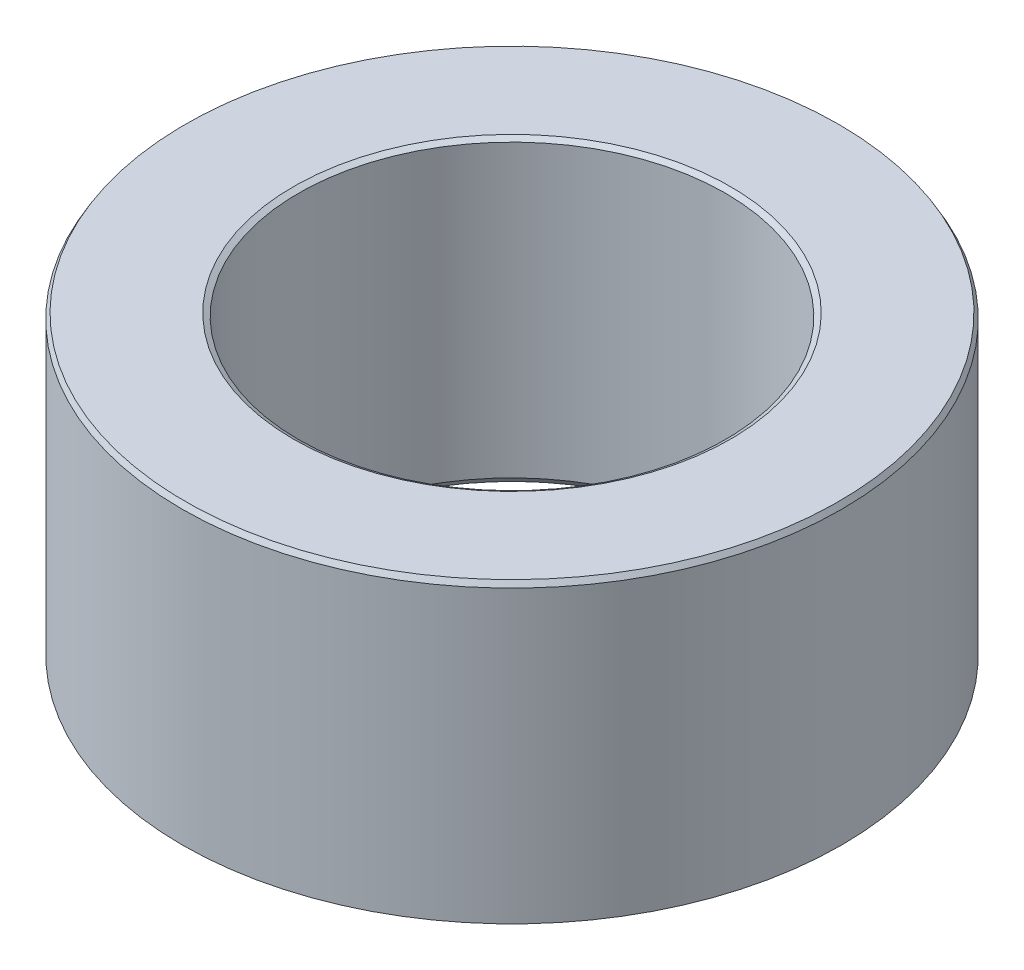
ISO-10303-21;
HEADER;
FILE_DESCRIPTION(('STEP AP214'),'2;1');
FILE_NAME('part.step','',(''),(''),'','','');
FILE_SCHEMA(('AUTOMOTIVE_DESIGN { 1 0 10303 214 1 1 1 1 }'));
ENDSEC;
DATA;
#1=APPLICATION_CONTEXT('core data for automotive mechanical design processes');
#2=APPLICATION_PROTOCOL_DEFINITION('international standard','automotive_design',2000,#1);
#3=PRODUCT_CONTEXT('',#1,'mechanical');
#4=PRODUCT('Part','Part','',(#3));
#5=PRODUCT_RELATED_PRODUCT_CATEGORY('part','',(#4));
#6=PRODUCT_DEFINITION_FORMATION('','',#4);
#7=PRODUCT_DEFINITION_CONTEXT('part definition',#1,'design');
#8=PRODUCT_DEFINITION('design','',#6,#7);
#9=PRODUCT_DEFINITION_SHAPE('','',#8);
#10=(LENGTH_UNIT() NAMED_UNIT(*) SI_UNIT(.MILLI.,.METRE.));
#11=(NAMED_UNIT(*) PLANE_ANGLE_UNIT() SI_UNIT($,.RADIAN.));
#12=(NAMED_UNIT(*) SI_UNIT($,.STERADIAN.) SOLID_ANGLE_UNIT());
#13=UNCERTAINTY_MEASURE_WITH_UNIT(LENGTH_MEASURE(1.E-05),#10,'distance_accuracy_value','');
#14=(GEOMETRIC_REPRESENTATION_CONTEXT(3) GLOBAL_UNCERTAINTY_ASSIGNED_CONTEXT((#13)) GLOBAL_UNIT_ASSIGNED_CONTEXT((#10,
#11,#12)) REPRESENTATION_CONTEXT('',''));
#15=CARTESIAN_POINT('',(0.,0.,0.));
#16=DIRECTION('',(0.,0.,1.));
#17=DIRECTION('',(1.,0.,0.));
#18=AXIS2_PLACEMENT_3D('',#15,#16,#17);
#19=CARTESIAN_POINT('',(0.,40.8145673028736,0.));
#20=DIRECTION('',(0.,-1.,0.));
#21=DIRECTION('',(0.,0.,-1.));
#22=AXIS2_PLACEMENT_3D('',#19,#20,#21);
#23=CYLINDRICAL_SURFACE('',#22,45.);
#24=CARTESIAN_POINT('',(0.,0.411539080149875,0.));
#25=DIRECTION('',(0.,1.,0.));
#26=DIRECTION('',(0.,0.,1.));
#27=AXIS2_PLACEMENT_3D('',#24,#25,#26);
#28=CIRCLE('',#27,45.);
#29=CARTESIAN_POINT('',(0.,0.411539080149875,45.));
#30=VERTEX_POINT('',#29);
#31=EDGE_CURVE('E10',#30,#30,#28,.T.);
#32=ORIENTED_EDGE('',*,*,#31,.T.);
#33=EDGE_LOOP('',(#32));
#34=FACE_BOUND('',#33,.T.);
#35=CARTESIAN_POINT('',(0.,40.1017607067538,0.));
#36=DIRECTION('',(0.,1.,0.));
#37=DIRECTION('',(0.,0.,1.));
#38=AXIS2_PLACEMENT_3D('',#35,#36,#37);
#39=CIRCLE('',#38,45.);
#40=CARTESIAN_POINT('',(0.,40.1017607067538,-45.));
#41=VERTEX_POINT('',#40);
#42=EDGE_CURVE('E50',#41,#41,#39,.F.);
#43=ORIENTED_EDGE('',*,*,#42,.T.);
#44=EDGE_LOOP('',(#43));
#45=FACE_BOUND('',#44,.T.);
#46=ADVANCED_FACE('F39',(#34,#45),#23,.T.);
#47=CARTESIAN_POINT('',(0.,40.8145673028736,0.));
#48=DIRECTION('',(0.,1.,0.));
#49=DIRECTION('',(0.,0.,1.));
#50=AXIS2_PLACEMENT_3D('',#47,#48,#49);
#51=PLANE('',#50);
#52=CARTESIAN_POINT('',(0.,40.8145673028736,0.));
#53=DIRECTION('',(0.,1.,0.));
#54=DIRECTION('',(0.,0.,1.));
#55=AXIS2_PLACEMENT_3D('',#52,#53,#54);
#56=CIRCLE('',#55,29.8444620948101);
#57=CARTESIAN_POINT('',(0.,40.8145673028736,29.8444620948101));
#58=VERTEX_POINT('',#57);
#59=EDGE_CURVE('E58',#58,#58,#56,.F.);
#60=ORIENTED_EDGE('',*,*,#59,.T.);
#61=EDGE_LOOP('',(#60));
#62=FACE_BOUND('',#61,.T.);
#63=CARTESIAN_POINT('',(0.,40.8145673028736,0.));
#64=DIRECTION('',(0.,1.,0.));
#65=DIRECTION('',(0.,0.,1.));
#66=AXIS2_PLACEMENT_3D('',#63,#64,#65);
#67=CIRCLE('',#66,44.5884609198501);
#68=CARTESIAN_POINT('',(0.,40.8145673028736,-44.5884609198501));
#69=VERTEX_POINT('',#68);
#70=EDGE_CURVE('E61',#69,#69,#67,.T.);
#71=ORIENTED_EDGE('',*,*,#70,.T.);
#72=EDGE_LOOP('',(#71));
#73=FACE_BOUND('',#72,.T.);
#74=ADVANCED_FACE('F88',(#62,#73),#51,.T.);
#75=CARTESIAN_POINT('',(0.,0.,0.));
#76=DIRECTION('',(0.,1.,0.));
#77=DIRECTION('',(0.,0.,1.));
#78=AXIS2_PLACEMENT_3D('',#75,#76,#77);
#79=PLANE('',#78);
#80=CARTESIAN_POINT('',(0.,0.,0.));
#81=DIRECTION('',(0.,1.,0.));
#82=DIRECTION('',(0.,0.,1.));
#83=AXIS2_PLACEMENT_3D('',#80,#81,#82);
#84=CIRCLE('',#83,29.5431945788402);
#85=CARTESIAN_POINT('',(0.,0.,29.5431945788402));
#86=VERTEX_POINT('',#85);
#87=EDGE_CURVE('E51',#86,#86,#84,.T.);
#88=ORIENTED_EDGE('',*,*,#87,.T.);
#89=EDGE_LOOP('',(#88));
#90=FACE_BOUND('',#89,.T.);
#91=CARTESIAN_POINT('',(0.,0.,0.));
#92=DIRECTION('',(0.,1.,0.));
#93=DIRECTION('',(0.,0.,1.));
#94=AXIS2_PLACEMENT_3D('',#91,#92,#93);
#95=CIRCLE('',#94,44.2871934038803);
#96=CARTESIAN_POINT('',(0.,0.,44.2871934038803));
#97=VERTEX_POINT('',#96);
#98=EDGE_CURVE('E54',#97,#97,#95,.F.);
#99=ORIENTED_EDGE('',*,*,#98,.T.);
#100=EDGE_LOOP('',(#99));
#101=FACE_BOUND('',#100,.T.);
#102=ADVANCED_FACE('F83',(#90,#101),#79,.F.);
#103=CARTESIAN_POINT('',(0.,40.8145673028736,0.));
#104=DIRECTION('',(0.,-1.,0.));
#105=DIRECTION('',(0.,0.,-1.));
#106=AXIS2_PLACEMENT_3D('',#103,#104,#105);
#107=CYLINDRICAL_SURFACE('',#106,29.1316554986903);
#108=CARTESIAN_POINT('',(0.,40.4030282227237,0.));
#109=DIRECTION('',(0.,1.,0.));
#110=DIRECTION('',(0.,0.,1.));
#111=AXIS2_PLACEMENT_3D('',#108,#109,#110);
#112=CIRCLE('',#111,29.1316554986903);
#113=CARTESIAN_POINT('',(0.,40.4030282227237,29.1316554986903));
#114=VERTEX_POINT('',#113);
#115=EDGE_CURVE('E67',#114,#114,#112,.T.);
#116=ORIENTED_EDGE('',*,*,#115,.T.);
#117=EDGE_LOOP('',(#116));
#118=FACE_BOUND('',#117,.T.);
#119=CARTESIAN_POINT('',(0.,0.712806596119713,0.));
#120=DIRECTION('',(0.,1.,0.));
#121=DIRECTION('',(0.,0.,1.));
#122=AXIS2_PLACEMENT_3D('',#119,#120,#121);
#123=CIRCLE('',#122,29.1316554986903);
#124=CARTESIAN_POINT('',(0.,0.712806596119713,29.1316554986903));
#125=VERTEX_POINT('',#124);
#126=EDGE_CURVE('E69',#125,#125,#123,.F.);
#127=ORIENTED_EDGE('',*,*,#126,.T.);
#128=EDGE_LOOP('',(#127));
#129=FACE_BOUND('',#128,.T.);
#130=ADVANCED_FACE('F71',(#118,#129),#107,.F.);
#131=CARTESIAN_POINT('',(0.,40.4030282227237,0.));
#132=DIRECTION('',(0.,1.,0.));
#133=DIRECTION('',(0.,0.,1.));
#134=AXIS2_PLACEMENT_3D('',#131,#132,#133);
#135=CONICAL_SURFACE('',#134,29.1316554986903,1.04719755119659);
#136=ORIENTED_EDGE('',*,*,#59,.F.);
#137=EDGE_LOOP('',(#136));
#138=FACE_BOUND('',#137,.T.);
#139=ORIENTED_EDGE('',*,*,#115,.F.);
#140=EDGE_LOOP('',(#139));
#141=FACE_BOUND('',#140,.T.);
#142=ADVANCED_FACE('F77',(#138,#141),#135,.F.);
#143=CARTESIAN_POINT('',(0.,0.,0.));
#144=DIRECTION('',(0.,-1.,0.));
#145=DIRECTION('',(0.,0.,-1.));
#146=AXIS2_PLACEMENT_3D('',#143,#144,#145);
#147=CONICAL_SURFACE('',#146,29.5431945788402,0.5235987755983);
#148=ORIENTED_EDGE('',*,*,#126,.F.);
#149=EDGE_LOOP('',(#148));
#150=FACE_BOUND('',#149,.T.);
#151=ORIENTED_EDGE('',*,*,#87,.F.);
#152=EDGE_LOOP('',(#151));
#153=FACE_BOUND('',#152,.T.);
#154=ADVANCED_FACE('F73',(#150,#153),#147,.F.);
#155=CARTESIAN_POINT('',(0.,0.411539080149875,0.));
#156=DIRECTION('',(0.,1.,0.));
#157=DIRECTION('',(0.,0.,1.));
#158=AXIS2_PLACEMENT_3D('',#155,#156,#157);
#159=CONICAL_SURFACE('',#158,45.,1.0471975511966);
#160=ORIENTED_EDGE('',*,*,#98,.F.);
#161=EDGE_LOOP('',(#160));
#162=FACE_BOUND('',#161,.T.);
#163=ORIENTED_EDGE('',*,*,#31,.F.);
#164=EDGE_LOOP('',(#163));
#165=FACE_BOUND('',#164,.T.);
#166=ADVANCED_FACE('F76',(#162,#165),#159,.T.);
#167=CARTESIAN_POINT('',(0.,40.8145673028736,0.));
#168=DIRECTION('',(0.,-1.,0.));
#169=DIRECTION('',(0.,0.,-1.));
#170=AXIS2_PLACEMENT_3D('',#167,#168,#169);
#171=CONICAL_SURFACE('',#170,44.5884609198501,0.523598775598311);
#172=CARTESIAN_POINT('',(0.,40.1017607067538,-45.));
#173=CARTESIAN_POINT('',(0.,40.1091857754634,-44.9957131345818));
#174=CARTESIAN_POINT('',(0.,40.116610844173,-44.9914262691636));
#175=CARTESIAN_POINT('',(0.,40.1314609815921,-44.9828525383271));
#176=CARTESIAN_POINT('',(0.,40.1388860503017,-44.9785656729089));
#177=CARTESIAN_POINT('',(0.,40.1537361877209,-44.9699919420724));
#178=CARTESIAN_POINT('',(0.,40.1611612564304,-44.9657050766542));
#179=CARTESIAN_POINT('',(0.,40.1760113938496,-44.9571313458177));
#180=CARTESIAN_POINT('',(0.,40.1834364625592,-44.9528444803995));
#181=CARTESIAN_POINT('',(0.,40.1982865999783,-44.944270749563));
#182=CARTESIAN_POINT('',(0.,40.2057116686879,-44.9399838841448));
#183=CARTESIAN_POINT('',(0.,40.2205618061071,-44.9314101533084));
#184=CARTESIAN_POINT('',(0.,40.2279868748167,-44.9271232878901));
#185=CARTESIAN_POINT('',(0.,40.2428370122358,-44.9185495570537));
#186=CARTESIAN_POINT('',(0.,40.2502620809454,-44.9142626916355));
#187=CARTESIAN_POINT('',(0.,40.2651122183646,-44.905688960799));
#188=CARTESIAN_POINT('',(0.,40.2725372870742,-44.9014020953808));
#189=CARTESIAN_POINT('',(0.,40.2873874244933,-44.8928283645443));
#190=CARTESIAN_POINT('',(0.,40.2948124932029,-44.8885414991261));
#191=CARTESIAN_POINT('',(0.,40.3096626306221,-44.8799677682896));
#192=CARTESIAN_POINT('',(0.,40.3170876993316,-44.8756809028714));
#193=CARTESIAN_POINT('',(0.,40.3319378367508,-44.8671071720349));
#194=CARTESIAN_POINT('',(0.,40.3393629054604,-44.8628203066167));
#195=CARTESIAN_POINT('',(0.,40.3542130428796,-44.8542465757803));
#196=CARTESIAN_POINT('',(0.,40.3616381115891,-44.849959710362));
#197=CARTESIAN_POINT('',(0.,40.3764882490083,-44.8413859795256));
#198=CARTESIAN_POINT('',(0.,40.3839133177179,-44.8370991141073));
#199=CARTESIAN_POINT('',(0.,40.398763455137,-44.8285253832709));
#200=CARTESIAN_POINT('',(0.,40.4061885238466,-44.8242385178527));
#201=CARTESIAN_POINT('',(0.,40.4210386612658,-44.8156647870162));
#202=CARTESIAN_POINT('',(0.,40.4284637299754,-44.811377921598));
#203=CARTESIAN_POINT('',(0.,40.4433138673945,-44.8028041907615));
#204=CARTESIAN_POINT('',(0.,40.4507389361041,-44.7985173253433));
#205=CARTESIAN_POINT('',(0.,40.4655890735233,-44.7899435945068));
#206=CARTESIAN_POINT('',(0.,40.4730141422328,-44.7856567290886));
#207=CARTESIAN_POINT('',(0.,40.487864279652,-44.7770829982521));
#208=CARTESIAN_POINT('',(0.,40.4952893483616,-44.7727961328339));
#209=CARTESIAN_POINT('',(0.,40.5101394857807,-44.7642224019975));
#210=CARTESIAN_POINT('',(0.,40.5175645544903,-44.7599355365792));
#211=CARTESIAN_POINT('',(0.,40.5324146919095,-44.7513618057428));
#212=CARTESIAN_POINT('',(0.,40.5398397606191,-44.7470749403246));
#213=CARTESIAN_POINT('',(0.,40.5546898980382,-44.7385012094881));
#214=CARTESIAN_POINT('',(0.,40.5621149667478,-44.7342143440699));
#215=CARTESIAN_POINT('',(0.,40.576965104167,-44.7256406132334));
#216=CARTESIAN_POINT('',(0.,40.5843901728766,-44.7213537478152));
#217=CARTESIAN_POINT('',(0.,40.5992403102957,-44.7127800169787));
#218=CARTESIAN_POINT('',(0.,40.6066653790053,-44.7084931515605));
#219=CARTESIAN_POINT('',(0.,40.6215155164245,-44.699919420724));
#220=CARTESIAN_POINT('',(0.,40.628940585134,-44.6956325553058));
#221=CARTESIAN_POINT('',(0.,40.6437907225532,-44.6870588244694));
#222=CARTESIAN_POINT('',(0.,40.6512157912628,-44.6827719590511));
#223=CARTESIAN_POINT('',(0.,40.6660659286819,-44.6741982282147));
#224=CARTESIAN_POINT('',(0.,40.6734909973915,-44.6699113627964));
#225=CARTESIAN_POINT('',(0.,40.6883411348107,-44.66133763196));
#226=CARTESIAN_POINT('',(0.,40.6957662035203,-44.6570507665418));
#227=CARTESIAN_POINT('',(0.,40.7106163409394,-44.6484770357053));
#228=CARTESIAN_POINT('',(0.,40.718041409649,-44.6441901702871));
#229=CARTESIAN_POINT('',(0.,40.7328915470682,-44.6356164394506));
#230=CARTESIAN_POINT('',(0.,40.7403166157778,-44.6313295740324));
#231=CARTESIAN_POINT('',(0.,40.7551667531969,-44.6227558431959));
#232=CARTESIAN_POINT('',(0.,40.7625918219065,-44.6184689777777));
#233=CARTESIAN_POINT('',(0.,40.7774419593256,-44.6098952469412));
#234=CARTESIAN_POINT('',(0.,40.7848670280352,-44.605608381523));
#235=CARTESIAN_POINT('',(0.,40.7997171654544,-44.5970346506866));
#236=CARTESIAN_POINT('',(0.,40.807142234164,-44.5927477852683));
#237=CARTESIAN_POINT('',(0.,40.8145673028736,-44.5884609198501));
#238=B_SPLINE_CURVE_WITH_KNOTS('',3,(#172,#173,#174,#175,#176,#177,#178,#179,#180,#181,#182,
#183,#184,#185,#186,#187,#188,#189,#190,#191,#192,#193,#194,#195,#196,#197,#198,#199,#200,#201,
#202,#203,#204,#205,#206,#207,#208,#209,#210,#211,#212,#213,#214,#215,#216,#217,#218,#219,#220,
#221,#222,#223,#224,#225,#226,#227,#228,#229,#230,#231,#232,#233,#234,#235,#236,#237),
.UNSPECIFIED.,.F.,.F.,(4,2,2,2,2,2,2,2,2,2,2,2,2,2,2,2,2,2,2,2,2,2,2,2,2,2,2,2,2,2,2,2,4),(0.,
0.0257211925093652,0.0514423850187339,0.0771635775280991,0.102884770037468,0.128605962546833,
0.154327155056208,0.180048347565573,0.205769540074938,0.231490732584307,0.257211925093672,
0.282933117603047,0.308654310112412,0.334375502621781,0.360096695131146,0.385817887640515,
0.411539080149886,0.437260272659255,0.46298146516862,0.488702657677989,0.514423850187354,
0.540145042696723,0.565866235206094,0.591587427715459,0.617308620224828,0.643029812734193,
0.668751005243562,0.694472197752933,0.720193390262302,0.745914582771667,0.771635775281036,
0.797356967790401,0.823078160299776),.UNSPECIFIED.);
#239=EDGE_CURVE('BSEAM45',#41,#69,#238,.T.);
#240=ORIENTED_EDGE('',*,*,#42,.F.);
#241=ORIENTED_EDGE('',*,*,#70,.F.);
#242=ORIENTED_EDGE('',*,*,#239,.T.);
#243=ORIENTED_EDGE('',*,*,#239,.F.);
#244=EDGE_LOOP('',(#240,#242,#241,#243));
#245=FACE_BOUND('',#244,.T.);
#246=ADVANCED_FACE('F45',(#245),#171,.T.);
#247=CLOSED_SHELL('',(#46,#74,#102,#130,#142,#154,#166,#246));
#248=MANIFOLD_SOLID_BREP('B2',#247);
#249=ADVANCED_BREP_SHAPE_REPRESENTATION('',(#18,#248),#14);
#250=SHAPE_DEFINITION_REPRESENTATION(#9,#249);
ENDSEC;
END-ISO-10303-21;
